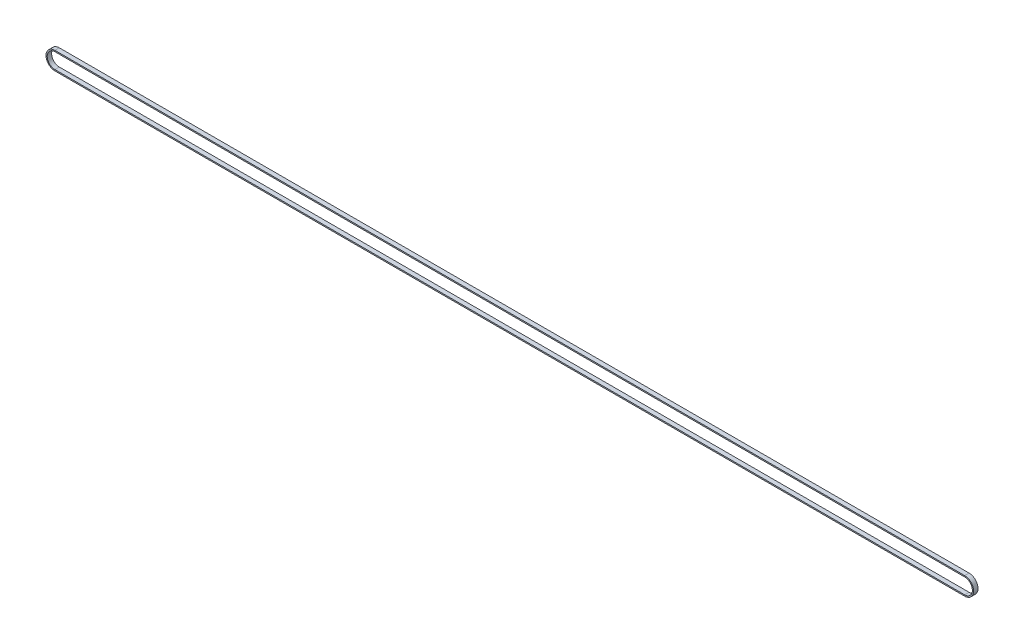
ISO-10303-21;
HEADER;
FILE_DESCRIPTION(('STEP AP214'),'2;1');
FILE_NAME('part.step','',(''),(''),'','','');
FILE_SCHEMA(('AUTOMOTIVE_DESIGN { 1 0 10303 214 1 1 1 1 }'));
ENDSEC;
DATA;
#1=APPLICATION_CONTEXT('core data for automotive mechanical design processes');
#2=APPLICATION_PROTOCOL_DEFINITION('international standard','automotive_design',2000,#1);
#3=PRODUCT_CONTEXT('',#1,'mechanical');
#4=PRODUCT('Part','Part','',(#3));
#5=PRODUCT_RELATED_PRODUCT_CATEGORY('part','',(#4));
#6=PRODUCT_DEFINITION_FORMATION('','',#4);
#7=PRODUCT_DEFINITION_CONTEXT('part definition',#1,'design');
#8=PRODUCT_DEFINITION('design','',#6,#7);
#9=PRODUCT_DEFINITION_SHAPE('','',#8);
#10=(LENGTH_UNIT() NAMED_UNIT(*) SI_UNIT(.MILLI.,.METRE.));
#11=(NAMED_UNIT(*) PLANE_ANGLE_UNIT() SI_UNIT($,.RADIAN.));
#12=(NAMED_UNIT(*) SI_UNIT($,.STERADIAN.) SOLID_ANGLE_UNIT());
#13=UNCERTAINTY_MEASURE_WITH_UNIT(LENGTH_MEASURE(1.E-05),#10,'distance_accuracy_value','');
#14=(GEOMETRIC_REPRESENTATION_CONTEXT(3) GLOBAL_UNCERTAINTY_ASSIGNED_CONTEXT((#13)) GLOBAL_UNIT_ASSIGNED_CONTEXT((#10,
#11,#12)) REPRESENTATION_CONTEXT('',''));
#15=CARTESIAN_POINT('',(0.,0.,0.));
#16=DIRECTION('',(0.,0.,1.));
#17=DIRECTION('',(1.,0.,0.));
#18=AXIS2_PLACEMENT_3D('',#15,#16,#17);
#19=CARTESIAN_POINT('',(0.,0.,2.5));
#20=DIRECTION('',(0.,0.,1.));
#21=DIRECTION('',(1.,0.,0.));
#22=AXIS2_PLACEMENT_3D('',#19,#20,#21);
#23=PLANE('',#22);
#24=CARTESIAN_POINT('',(0.,0.,2.5));
#25=DIRECTION('',(0.,0.,1.));
#26=DIRECTION('',(1.,0.,0.));
#27=AXIS2_PLACEMENT_3D('',#24,#25,#26);
#28=CIRCLE('',#27,10.13);
#29=CARTESIAN_POINT('',(0.,10.13,2.5));
#30=VERTEX_POINT('',#29);
#31=CARTESIAN_POINT('',(0.,-10.13,2.5));
#32=VERTEX_POINT('',#31);
#33=EDGE_CURVE('E158',#30,#32,#28,.T.);
#34=ORIENTED_EDGE('',*,*,#33,.T.);
#35=DIRECTION('',(1.,0.,0.));
#36=VECTOR('',#35,1.);
#37=CARTESIAN_POINT('',(1032.,-10.13,2.5));
#38=LINE('',#37,#36);
#39=CARTESIAN_POINT('',(1032.,-10.13,2.5));
#40=VERTEX_POINT('',#39);
#41=EDGE_CURVE('E161',#32,#40,#38,.T.);
#42=ORIENTED_EDGE('',*,*,#41,.T.);
#43=CARTESIAN_POINT('',(1032.,0.,2.5));
#44=DIRECTION('',(0.,0.,1.));
#45=DIRECTION('',(1.,0.,0.));
#46=AXIS2_PLACEMENT_3D('',#43,#44,#45);
#47=CIRCLE('',#46,10.13);
#48=CARTESIAN_POINT('',(1032.,10.13,2.5));
#49=VERTEX_POINT('',#48);
#50=EDGE_CURVE('E164',#40,#49,#47,.T.);
#51=ORIENTED_EDGE('',*,*,#50,.T.);
#52=DIRECTION('',(-1.,0.,0.));
#53=VECTOR('',#52,1.);
#54=CARTESIAN_POINT('',(0.,10.13,2.5));
#55=LINE('',#54,#53);
#56=EDGE_CURVE('E166',#49,#30,#55,.T.);
#57=ORIENTED_EDGE('',*,*,#56,.T.);
#58=EDGE_LOOP('',(#34,#42,#51,#57));
#59=FACE_BOUND('',#58,.T.);
#60=DIRECTION('',(1.,0.,0.));
#61=VECTOR('',#60,1.);
#62=CARTESIAN_POINT('',(1032.,-8.75,2.5));
#63=LINE('',#62,#61);
#64=CARTESIAN_POINT('',(0.,-8.75,2.5));
#65=VERTEX_POINT('',#64);
#66=CARTESIAN_POINT('',(1032.,-8.75,2.5));
#67=VERTEX_POINT('',#66);
#68=EDGE_CURVE('E130',#65,#67,#63,.T.);
#69=ORIENTED_EDGE('',*,*,#68,.F.);
#70=CARTESIAN_POINT('',(0.,0.,2.5));
#71=DIRECTION('',(0.,0.,1.));
#72=DIRECTION('',(1.,0.,0.));
#73=AXIS2_PLACEMENT_3D('',#70,#71,#72);
#74=CIRCLE('',#73,8.75);
#75=CARTESIAN_POINT('',(0.,8.75,2.5));
#76=VERTEX_POINT('',#75);
#77=EDGE_CURVE('E122',#76,#65,#74,.T.);
#78=ORIENTED_EDGE('',*,*,#77,.F.);
#79=DIRECTION('',(-1.,0.,0.));
#80=VECTOR('',#79,1.);
#81=CARTESIAN_POINT('',(0.,8.75,2.5));
#82=LINE('',#81,#80);
#83=CARTESIAN_POINT('',(1032.,8.75,2.5));
#84=VERTEX_POINT('',#83);
#85=EDGE_CURVE('E144',#84,#76,#82,.T.);
#86=ORIENTED_EDGE('',*,*,#85,.F.);
#87=CARTESIAN_POINT('',(1032.,0.,2.5));
#88=DIRECTION('',(0.,0.,1.));
#89=DIRECTION('',(1.,0.,0.));
#90=AXIS2_PLACEMENT_3D('',#87,#88,#89);
#91=CIRCLE('',#90,8.75);
#92=EDGE_CURVE('E142',#67,#84,#91,.T.);
#93=ORIENTED_EDGE('',*,*,#92,.F.);
#94=EDGE_LOOP('',(#69,#78,#86,#93));
#95=FACE_BOUND('',#94,.T.);
#96=ADVANCED_FACE('F57',(#59,#95),#23,.T.);
#97=CARTESIAN_POINT('',(0.,0.,-2.5));
#98=DIRECTION('',(0.,0.,1.));
#99=DIRECTION('',(1.,0.,0.));
#100=AXIS2_PLACEMENT_3D('',#97,#98,#99);
#101=PLANE('',#100);
#102=CARTESIAN_POINT('',(0.,0.,-2.5));
#103=DIRECTION('',(0.,0.,1.));
#104=DIRECTION('',(1.,0.,0.));
#105=AXIS2_PLACEMENT_3D('',#102,#103,#104);
#106=CIRCLE('',#105,10.13);
#107=CARTESIAN_POINT('',(0.,10.13,-2.5));
#108=VERTEX_POINT('',#107);
#109=CARTESIAN_POINT('',(0.,-10.13,-2.5));
#110=VERTEX_POINT('',#109);
#111=EDGE_CURVE('E138',#108,#110,#106,.T.);
#112=ORIENTED_EDGE('',*,*,#111,.F.);
#113=DIRECTION('',(-1.,0.,0.));
#114=VECTOR('',#113,1.);
#115=CARTESIAN_POINT('',(0.,10.13,-2.5));
#116=LINE('',#115,#114);
#117=CARTESIAN_POINT('',(1032.,10.13,-2.5));
#118=VERTEX_POINT('',#117);
#119=EDGE_CURVE('E162',#118,#108,#116,.T.);
#120=ORIENTED_EDGE('',*,*,#119,.F.);
#121=CARTESIAN_POINT('',(1032.,0.,-2.5));
#122=DIRECTION('',(0.,0.,1.));
#123=DIRECTION('',(1.,0.,0.));
#124=AXIS2_PLACEMENT_3D('',#121,#122,#123);
#125=CIRCLE('',#124,10.13);
#126=CARTESIAN_POINT('',(1032.,-10.13,-2.5));
#127=VERTEX_POINT('',#126);
#128=EDGE_CURVE('E173',#127,#118,#125,.T.);
#129=ORIENTED_EDGE('',*,*,#128,.F.);
#130=DIRECTION('',(1.,0.,0.));
#131=VECTOR('',#130,1.);
#132=CARTESIAN_POINT('',(1032.,-10.13,-2.5));
#133=LINE('',#132,#131);
#134=EDGE_CURVE('E171',#110,#127,#133,.T.);
#135=ORIENTED_EDGE('',*,*,#134,.F.);
#136=EDGE_LOOP('',(#112,#120,#129,#135));
#137=FACE_BOUND('',#136,.T.);
#138=CARTESIAN_POINT('',(0.,0.,-2.5));
#139=DIRECTION('',(0.,0.,1.));
#140=DIRECTION('',(1.,0.,0.));
#141=AXIS2_PLACEMENT_3D('',#138,#139,#140);
#142=CIRCLE('',#141,8.75);
#143=CARTESIAN_POINT('',(0.,8.75,-2.5));
#144=VERTEX_POINT('',#143);
#145=CARTESIAN_POINT('',(0.,-8.75,-2.5));
#146=VERTEX_POINT('',#145);
#147=EDGE_CURVE('E80',#144,#146,#142,.T.);
#148=ORIENTED_EDGE('',*,*,#147,.T.);
#149=DIRECTION('',(1.,0.,0.));
#150=VECTOR('',#149,1.);
#151=CARTESIAN_POINT('',(1032.,-8.75,-2.5));
#152=LINE('',#151,#150);
#153=CARTESIAN_POINT('',(1032.,-8.75,-2.5));
#154=VERTEX_POINT('',#153);
#155=EDGE_CURVE('E137',#146,#154,#152,.T.);
#156=ORIENTED_EDGE('',*,*,#155,.T.);
#157=CARTESIAN_POINT('',(1032.,0.,-2.5));
#158=DIRECTION('',(0.,0.,1.));
#159=DIRECTION('',(1.,0.,0.));
#160=AXIS2_PLACEMENT_3D('',#157,#158,#159);
#161=CIRCLE('',#160,8.75);
#162=CARTESIAN_POINT('',(1032.,8.75,-2.5));
#163=VERTEX_POINT('',#162);
#164=EDGE_CURVE('E150',#154,#163,#161,.T.);
#165=ORIENTED_EDGE('',*,*,#164,.T.);
#166=DIRECTION('',(-1.,0.,0.));
#167=VECTOR('',#166,1.);
#168=CARTESIAN_POINT('',(0.,8.75,-2.5));
#169=LINE('',#168,#167);
#170=EDGE_CURVE('E131',#163,#144,#169,.T.);
#171=ORIENTED_EDGE('',*,*,#170,.T.);
#172=EDGE_LOOP('',(#148,#156,#165,#171));
#173=FACE_BOUND('',#172,.T.);
#174=ADVANCED_FACE('F191',(#137,#173),#101,.F.);
#175=CARTESIAN_POINT('',(0.,0.,2.5));
#176=DIRECTION('',(0.,0.,-1.));
#177=DIRECTION('',(-1.,0.,0.));
#178=AXIS2_PLACEMENT_3D('',#175,#176,#177);
#179=CYLINDRICAL_SURFACE('',#178,10.13);
#180=ORIENTED_EDGE('',*,*,#111,.T.);
#181=DIRECTION('',(0.,0.,-1.));
#182=VECTOR('',#181,1.);
#183=CARTESIAN_POINT('',(0.,-10.13,2.5));
#184=LINE('',#183,#182);
#185=EDGE_CURVE('E12',#32,#110,#184,.T.);
#186=ORIENTED_EDGE('',*,*,#185,.F.);
#187=ORIENTED_EDGE('',*,*,#33,.F.);
#188=DIRECTION('',(0.,0.,-1.));
#189=VECTOR('',#188,1.);
#190=CARTESIAN_POINT('',(0.,10.13,2.5));
#191=LINE('',#190,#189);
#192=EDGE_CURVE('E168',#30,#108,#191,.T.);
#193=ORIENTED_EDGE('',*,*,#192,.T.);
#194=EDGE_LOOP('',(#180,#186,#187,#193));
#195=FACE_BOUND('',#194,.T.);
#196=ADVANCED_FACE('F59',(#195),#179,.T.);
#197=CARTESIAN_POINT('',(1032.,-10.13,2.5));
#198=DIRECTION('',(0.,1.,0.));
#199=DIRECTION('',(0.,0.,1.));
#200=AXIS2_PLACEMENT_3D('',#197,#198,#199);
#201=PLANE('',#200);
#202=ORIENTED_EDGE('',*,*,#134,.T.);
#203=DIRECTION('',(0.,0.,-1.));
#204=VECTOR('',#203,1.);
#205=CARTESIAN_POINT('',(1032.,-10.13,2.5));
#206=LINE('',#205,#204);
#207=EDGE_CURVE('E65',#40,#127,#206,.T.);
#208=ORIENTED_EDGE('',*,*,#207,.F.);
#209=ORIENTED_EDGE('',*,*,#41,.F.);
#210=ORIENTED_EDGE('',*,*,#185,.T.);
#211=EDGE_LOOP('',(#202,#208,#209,#210));
#212=FACE_BOUND('',#211,.T.);
#213=ADVANCED_FACE('F201',(#212),#201,.F.);
#214=CARTESIAN_POINT('',(1032.,0.,2.5));
#215=DIRECTION('',(0.,0.,-1.));
#216=DIRECTION('',(-1.,0.,0.));
#217=AXIS2_PLACEMENT_3D('',#214,#215,#216);
#218=CYLINDRICAL_SURFACE('',#217,10.13);
#219=ORIENTED_EDGE('',*,*,#128,.T.);
#220=DIRECTION('',(0.,0.,-1.));
#221=VECTOR('',#220,1.);
#222=CARTESIAN_POINT('',(1032.,10.13,2.5));
#223=LINE('',#222,#221);
#224=EDGE_CURVE('E178',#49,#118,#223,.T.);
#225=ORIENTED_EDGE('',*,*,#224,.F.);
#226=ORIENTED_EDGE('',*,*,#50,.F.);
#227=ORIENTED_EDGE('',*,*,#207,.T.);
#228=EDGE_LOOP('',(#219,#225,#226,#227));
#229=FACE_BOUND('',#228,.T.);
#230=ADVANCED_FACE('F185',(#229),#218,.T.);
#231=CARTESIAN_POINT('',(0.,10.13,2.5));
#232=DIRECTION('',(0.,-1.,0.));
#233=DIRECTION('',(0.,0.,-1.));
#234=AXIS2_PLACEMENT_3D('',#231,#232,#233);
#235=PLANE('',#234);
#236=ORIENTED_EDGE('',*,*,#119,.T.);
#237=ORIENTED_EDGE('',*,*,#192,.F.);
#238=ORIENTED_EDGE('',*,*,#56,.F.);
#239=ORIENTED_EDGE('',*,*,#224,.T.);
#240=EDGE_LOOP('',(#236,#237,#238,#239));
#241=FACE_BOUND('',#240,.T.);
#242=ADVANCED_FACE('F195',(#241),#235,.F.);
#243=CARTESIAN_POINT('',(0.,0.,2.5));
#244=DIRECTION('',(0.,0.,-1.));
#245=DIRECTION('',(-1.,0.,0.));
#246=AXIS2_PLACEMENT_3D('',#243,#244,#245);
#247=CYLINDRICAL_SURFACE('',#246,8.75);
#248=ORIENTED_EDGE('',*,*,#147,.F.);
#249=DIRECTION('',(0.,0.,-1.));
#250=VECTOR('',#249,1.);
#251=CARTESIAN_POINT('',(0.,8.75,2.5));
#252=LINE('',#251,#250);
#253=EDGE_CURVE('E126',#76,#144,#252,.T.);
#254=ORIENTED_EDGE('',*,*,#253,.F.);
#255=ORIENTED_EDGE('',*,*,#77,.T.);
#256=DIRECTION('',(0.,0.,-1.));
#257=VECTOR('',#256,1.);
#258=CARTESIAN_POINT('',(0.,-8.75,2.5));
#259=LINE('',#258,#257);
#260=EDGE_CURVE('E125',#65,#146,#259,.T.);
#261=ORIENTED_EDGE('',*,*,#260,.T.);
#262=EDGE_LOOP('',(#248,#254,#255,#261));
#263=FACE_BOUND('',#262,.T.);
#264=ADVANCED_FACE('F124',(#263),#247,.F.);
#265=CARTESIAN_POINT('',(1032.,-8.75,2.5));
#266=DIRECTION('',(0.,1.,0.));
#267=DIRECTION('',(0.,0.,1.));
#268=AXIS2_PLACEMENT_3D('',#265,#266,#267);
#269=PLANE('',#268);
#270=ORIENTED_EDGE('',*,*,#155,.F.);
#271=ORIENTED_EDGE('',*,*,#260,.F.);
#272=ORIENTED_EDGE('',*,*,#68,.T.);
#273=DIRECTION('',(0.,0.,-1.));
#274=VECTOR('',#273,1.);
#275=CARTESIAN_POINT('',(1032.,-8.75,2.5));
#276=LINE('',#275,#274);
#277=EDGE_CURVE('E139',#67,#154,#276,.T.);
#278=ORIENTED_EDGE('',*,*,#277,.T.);
#279=EDGE_LOOP('',(#270,#271,#272,#278));
#280=FACE_BOUND('',#279,.T.);
#281=ADVANCED_FACE('F134',(#280),#269,.T.);
#282=CARTESIAN_POINT('',(1032.,0.,2.5));
#283=DIRECTION('',(0.,0.,-1.));
#284=DIRECTION('',(-1.,0.,0.));
#285=AXIS2_PLACEMENT_3D('',#282,#283,#284);
#286=CYLINDRICAL_SURFACE('',#285,8.75);
#287=ORIENTED_EDGE('',*,*,#164,.F.);
#288=ORIENTED_EDGE('',*,*,#277,.F.);
#289=ORIENTED_EDGE('',*,*,#92,.T.);
#290=DIRECTION('',(0.,0.,-1.));
#291=VECTOR('',#290,1.);
#292=CARTESIAN_POINT('',(1032.,8.75,2.5));
#293=LINE('',#292,#291);
#294=EDGE_CURVE('E72',#84,#163,#293,.T.);
#295=ORIENTED_EDGE('',*,*,#294,.T.);
#296=EDGE_LOOP('',(#287,#288,#289,#295));
#297=FACE_BOUND('',#296,.T.);
#298=ADVANCED_FACE('F224',(#297),#286,.F.);
#299=CARTESIAN_POINT('',(0.,8.75,2.5));
#300=DIRECTION('',(0.,-1.,0.));
#301=DIRECTION('',(0.,0.,-1.));
#302=AXIS2_PLACEMENT_3D('',#299,#300,#301);
#303=PLANE('',#302);
#304=ORIENTED_EDGE('',*,*,#170,.F.);
#305=ORIENTED_EDGE('',*,*,#294,.F.);
#306=ORIENTED_EDGE('',*,*,#85,.T.);
#307=ORIENTED_EDGE('',*,*,#253,.T.);
#308=EDGE_LOOP('',(#304,#305,#306,#307));
#309=FACE_BOUND('',#308,.T.);
#310=ADVANCED_FACE('F228',(#309),#303,.T.);
#311=CLOSED_SHELL('',(#96,#174,#196,#213,#230,#242,#264,#281,#298,#310));
#312=MANIFOLD_SOLID_BREP('B2',#311);
#313=ADVANCED_BREP_SHAPE_REPRESENTATION('',(#18,#312),#14);
#314=SHAPE_DEFINITION_REPRESENTATION(#9,#313);
ENDSEC;
END-ISO-10303-21;
